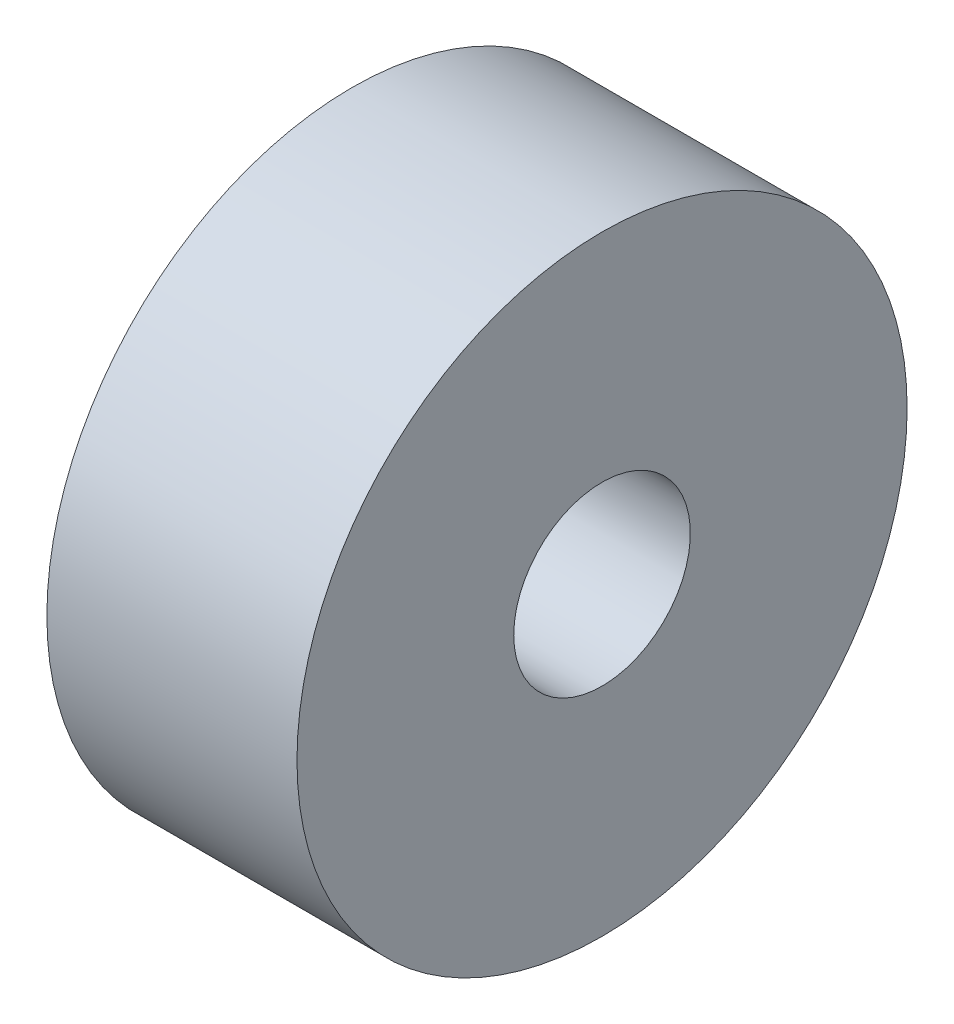
ISO-10303-21;
HEADER;
FILE_DESCRIPTION(('STEP AP214'),'2;1');
FILE_NAME('part.step','',(''),(''),'','','');
FILE_SCHEMA(('AUTOMOTIVE_DESIGN { 1 0 10303 214 1 1 1 1 }'));
ENDSEC;
DATA;
#1=APPLICATION_CONTEXT('core data for automotive mechanical design processes');
#2=APPLICATION_PROTOCOL_DEFINITION('international standard','automotive_design',2000,#1);
#3=PRODUCT_CONTEXT('',#1,'mechanical');
#4=PRODUCT('Part','Part','',(#3));
#5=PRODUCT_RELATED_PRODUCT_CATEGORY('part','',(#4));
#6=PRODUCT_DEFINITION_FORMATION('','',#4);
#7=PRODUCT_DEFINITION_CONTEXT('part definition',#1,'design');
#8=PRODUCT_DEFINITION('design','',#6,#7);
#9=PRODUCT_DEFINITION_SHAPE('','',#8);
#10=(LENGTH_UNIT() NAMED_UNIT(*) SI_UNIT(.MILLI.,.METRE.));
#11=(NAMED_UNIT(*) PLANE_ANGLE_UNIT() SI_UNIT($,.RADIAN.));
#12=(NAMED_UNIT(*) SI_UNIT($,.STERADIAN.) SOLID_ANGLE_UNIT());
#13=UNCERTAINTY_MEASURE_WITH_UNIT(LENGTH_MEASURE(1.E-05),#10,'distance_accuracy_value','');
#14=(GEOMETRIC_REPRESENTATION_CONTEXT(3) GLOBAL_UNCERTAINTY_ASSIGNED_CONTEXT((#13)) GLOBAL_UNIT_ASSIGNED_CONTEXT((#10,
#11,#12)) REPRESENTATION_CONTEXT('',''));
#15=CARTESIAN_POINT('',(0.,0.,0.));
#16=DIRECTION('',(0.,0.,1.));
#17=DIRECTION('',(1.,0.,0.));
#18=AXIS2_PLACEMENT_3D('',#15,#16,#17);
#19=CARTESIAN_POINT('',(4.4958,0.,0.));
#20=DIRECTION('',(1.,0.,0.));
#21=DIRECTION('',(0.,0.,-1.));
#22=AXIS2_PLACEMENT_3D('',#19,#20,#21);
#23=PLANE('',#22);
#24=CARTESIAN_POINT('',(4.4958,0.,0.));
#25=DIRECTION('',(-1.,0.,0.));
#26=DIRECTION('',(0.,0.,1.));
#27=AXIS2_PLACEMENT_3D('',#24,#25,#26);
#28=CIRCLE('',#27,5.4839997);
#29=CARTESIAN_POINT('',(4.4958,0.,5.4839997));
#30=VERTEX_POINT('',#29);
#31=EDGE_CURVE('E27',#30,#30,#28,.T.);
#32=ORIENTED_EDGE('',*,*,#31,.F.);
#33=EDGE_LOOP('',(#32));
#34=FACE_BOUND('',#33,.T.);
#35=CARTESIAN_POINT('',(4.4958,0.,0.));
#36=DIRECTION('',(-1.,0.,0.));
#37=DIRECTION('',(0.,0.,1.));
#38=AXIS2_PLACEMENT_3D('',#35,#36,#37);
#39=CIRCLE('',#38,1.5875);
#40=CARTESIAN_POINT('',(4.4958,0.,1.5875));
#41=VERTEX_POINT('',#40);
#42=EDGE_CURVE('E18',#41,#41,#39,.T.);
#43=ORIENTED_EDGE('',*,*,#42,.T.);
#44=EDGE_LOOP('',(#43));
#45=FACE_BOUND('',#44,.T.);
#46=ADVANCED_FACE('F15',(#34,#45),#23,.T.);
#47=CARTESIAN_POINT('',(4.4958,0.,0.));
#48=DIRECTION('',(-1.,0.,0.));
#49=DIRECTION('',(0.,0.,1.));
#50=AXIS2_PLACEMENT_3D('',#47,#48,#49);
#51=CYLINDRICAL_SURFACE('',#50,1.5875);
#52=CARTESIAN_POINT('',(0.,0.,0.));
#53=DIRECTION('',(-1.,0.,0.));
#54=DIRECTION('',(0.,0.,1.));
#55=AXIS2_PLACEMENT_3D('',#52,#53,#54);
#56=CIRCLE('',#55,1.5875);
#57=CARTESIAN_POINT('',(0.,0.,1.5875));
#58=VERTEX_POINT('',#57);
#59=EDGE_CURVE('E22',#58,#58,#56,.T.);
#60=ORIENTED_EDGE('',*,*,#59,.T.);
#61=EDGE_LOOP('',(#60));
#62=FACE_BOUND('',#61,.T.);
#63=ORIENTED_EDGE('',*,*,#42,.F.);
#64=EDGE_LOOP('',(#63));
#65=FACE_BOUND('',#64,.T.);
#66=ADVANCED_FACE('F36',(#62,#65),#51,.F.);
#67=CARTESIAN_POINT('',(4.4958,0.,0.));
#68=DIRECTION('',(-1.,0.,0.));
#69=DIRECTION('',(0.,0.,1.));
#70=AXIS2_PLACEMENT_3D('',#67,#68,#69);
#71=CYLINDRICAL_SURFACE('',#70,5.4839997);
#72=ORIENTED_EDGE('',*,*,#31,.T.);
#73=EDGE_LOOP('',(#72));
#74=FACE_BOUND('',#73,.T.);
#75=CARTESIAN_POINT('',(0.,0.,0.));
#76=DIRECTION('',(-1.,0.,0.));
#77=DIRECTION('',(0.,0.,1.));
#78=AXIS2_PLACEMENT_3D('',#75,#76,#77);
#79=CIRCLE('',#78,5.4839997);
#80=CARTESIAN_POINT('',(0.,0.,5.4839997));
#81=VERTEX_POINT('',#80);
#82=EDGE_CURVE('E10',#81,#81,#79,.F.);
#83=ORIENTED_EDGE('',*,*,#82,.T.);
#84=EDGE_LOOP('',(#83));
#85=FACE_BOUND('',#84,.T.);
#86=ADVANCED_FACE('F38',(#74,#85),#71,.T.);
#87=CARTESIAN_POINT('',(0.,0.,0.));
#88=DIRECTION('',(1.,0.,0.));
#89=DIRECTION('',(0.,0.,-1.));
#90=AXIS2_PLACEMENT_3D('',#87,#88,#89);
#91=PLANE('',#90);
#92=ORIENTED_EDGE('',*,*,#82,.F.);
#93=EDGE_LOOP('',(#92));
#94=FACE_BOUND('',#93,.T.);
#95=ORIENTED_EDGE('',*,*,#59,.F.);
#96=EDGE_LOOP('',(#95));
#97=FACE_BOUND('',#96,.T.);
#98=ADVANCED_FACE('F45',(#94,#97),#91,.F.);
#99=CLOSED_SHELL('',(#46,#66,#86,#98));
#100=MANIFOLD_SOLID_BREP('B1',#99);
#101=ADVANCED_BREP_SHAPE_REPRESENTATION('',(#18,#100),#14);
#102=SHAPE_DEFINITION_REPRESENTATION(#9,#101);
ENDSEC;
END-ISO-10303-21;
